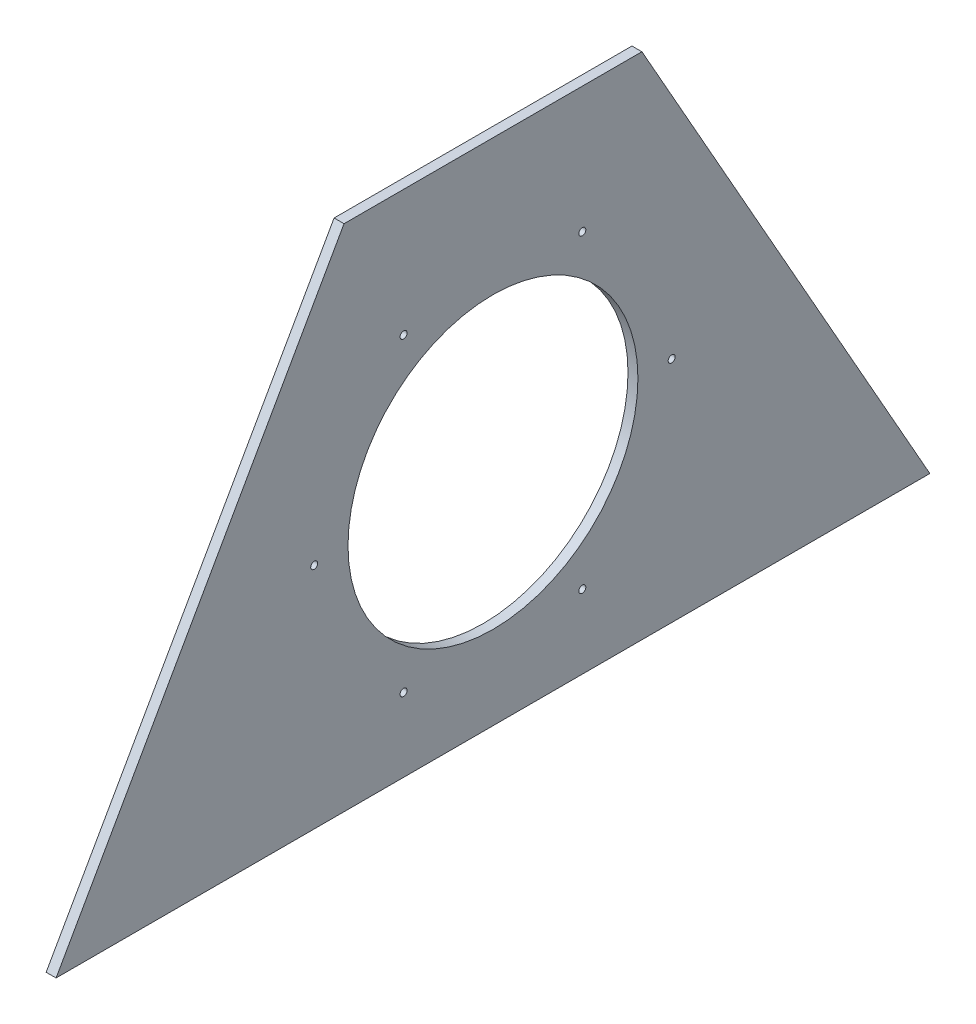
ISO-10303-21;
HEADER;
FILE_DESCRIPTION(('STEP AP214'),'2;1');
FILE_NAME('part.step','',(''),(''),'','','');
FILE_SCHEMA(('AUTOMOTIVE_DESIGN { 1 0 10303 214 1 1 1 1 }'));
ENDSEC;
DATA;
#1=APPLICATION_CONTEXT('core data for automotive mechanical design processes');
#2=APPLICATION_PROTOCOL_DEFINITION('international standard','automotive_design',2000,#1);
#3=PRODUCT_CONTEXT('',#1,'mechanical');
#4=PRODUCT('Part','Part','',(#3));
#5=PRODUCT_RELATED_PRODUCT_CATEGORY('part','',(#4));
#6=PRODUCT_DEFINITION_FORMATION('','',#4);
#7=PRODUCT_DEFINITION_CONTEXT('part definition',#1,'design');
#8=PRODUCT_DEFINITION('design','',#6,#7);
#9=PRODUCT_DEFINITION_SHAPE('','',#8);
#10=(LENGTH_UNIT() NAMED_UNIT(*) SI_UNIT(.MILLI.,.METRE.));
#11=(NAMED_UNIT(*) PLANE_ANGLE_UNIT() SI_UNIT($,.RADIAN.));
#12=(NAMED_UNIT(*) SI_UNIT($,.STERADIAN.) SOLID_ANGLE_UNIT());
#13=UNCERTAINTY_MEASURE_WITH_UNIT(LENGTH_MEASURE(1.E-05),#10,'distance_accuracy_value','');
#14=(GEOMETRIC_REPRESENTATION_CONTEXT(3) GLOBAL_UNCERTAINTY_ASSIGNED_CONTEXT((#13)) GLOBAL_UNIT_ASSIGNED_CONTEXT((#10,
#11,#12)) REPRESENTATION_CONTEXT('',''));
#15=CARTESIAN_POINT('',(0.,0.,0.));
#16=DIRECTION('',(0.,0.,1.));
#17=DIRECTION('',(1.,0.,0.));
#18=AXIS2_PLACEMENT_3D('',#15,#16,#17);
#19=CARTESIAN_POINT('',(6.35,0.,0.));
#20=DIRECTION('',(0.,-0.492192803801765,-0.870486211197947));
#21=DIRECTION('',(0.,0.870486211197947,-0.492192803801765));
#22=AXIS2_PLACEMENT_3D('',#19,#20,#21);
#23=PLANE('',#22);
#24=DIRECTION('',(0.,-0.870486211197947,0.492192803801765));
#25=VECTOR('',#24,1.);
#26=CARTESIAN_POINT('',(0.,0.,0.));
#27=LINE('',#26,#25);
#28=CARTESIAN_POINT('',(0.,325.685452030022,-184.15));
#29=VERTEX_POINT('',#28);
#30=CARTESIAN_POINT('',(0.,0.,0.));
#31=VERTEX_POINT('',#30);
#32=EDGE_CURVE('E100',#29,#31,#27,.T.);
#33=ORIENTED_EDGE('',*,*,#32,.T.);
#34=DIRECTION('',(-1.,0.,0.));
#35=VECTOR('',#34,1.);
#36=CARTESIAN_POINT('',(6.35,0.,0.));
#37=LINE('',#36,#35);
#38=CARTESIAN_POINT('',(6.35,0.,0.));
#39=VERTEX_POINT('',#38);
#40=EDGE_CURVE('E11',#39,#31,#37,.T.);
#41=ORIENTED_EDGE('',*,*,#40,.F.);
#42=DIRECTION('',(0.,-0.870486211197947,0.492192803801765));
#43=VECTOR('',#42,1.);
#44=CARTESIAN_POINT('',(6.35,0.,0.));
#45=LINE('',#44,#43);
#46=CARTESIAN_POINT('',(6.35,325.685452030022,-184.15));
#47=VERTEX_POINT('',#46);
#48=EDGE_CURVE('E87',#47,#39,#45,.T.);
#49=ORIENTED_EDGE('',*,*,#48,.F.);
#50=DIRECTION('',(-1.,0.,0.));
#51=VECTOR('',#50,1.);
#52=CARTESIAN_POINT('',(6.35,325.685452030022,-184.15));
#53=LINE('',#52,#51);
#54=EDGE_CURVE('E96',#47,#29,#53,.T.);
#55=ORIENTED_EDGE('',*,*,#54,.T.);
#56=EDGE_LOOP('',(#33,#41,#49,#55));
#57=FACE_BOUND('',#56,.T.);
#58=ADVANCED_FACE('F35',(#57),#23,.F.);
#59=CARTESIAN_POINT('',(6.35,0.,0.));
#60=DIRECTION('',(0.,1.,0.));
#61=DIRECTION('',(0.,0.,1.));
#62=AXIS2_PLACEMENT_3D('',#59,#60,#61);
#63=PLANE('',#62);
#64=DIRECTION('',(0.,0.,-1.));
#65=VECTOR('',#64,1.);
#66=CARTESIAN_POINT('',(0.,0.,0.));
#67=LINE('',#66,#65);
#68=CARTESIAN_POINT('',(0.,0.,-558.8));
#69=VERTEX_POINT('',#68);
#70=EDGE_CURVE('E91',#31,#69,#67,.T.);
#71=ORIENTED_EDGE('',*,*,#70,.T.);
#72=DIRECTION('',(-1.,0.,0.));
#73=VECTOR('',#72,1.);
#74=CARTESIAN_POINT('',(6.35,0.,-558.8));
#75=LINE('',#74,#73);
#76=CARTESIAN_POINT('',(6.35,0.,-558.8));
#77=VERTEX_POINT('',#76);
#78=EDGE_CURVE('E44',#77,#69,#75,.T.);
#79=ORIENTED_EDGE('',*,*,#78,.F.);
#80=DIRECTION('',(0.,0.,-1.));
#81=VECTOR('',#80,1.);
#82=CARTESIAN_POINT('',(6.35,0.,0.));
#83=LINE('',#82,#81);
#84=EDGE_CURVE('E82',#39,#77,#83,.T.);
#85=ORIENTED_EDGE('',*,*,#84,.F.);
#86=ORIENTED_EDGE('',*,*,#40,.T.);
#87=EDGE_LOOP('',(#71,#79,#85,#86));
#88=FACE_BOUND('',#87,.T.);
#89=ADVANCED_FACE('F90',(#88),#63,.F.);
#90=CARTESIAN_POINT('',(6.35,0.,-558.8));
#91=DIRECTION('',(0.,-0.492192803801765,0.870486211197947));
#92=DIRECTION('',(0.,-0.870486211197947,-0.492192803801765));
#93=AXIS2_PLACEMENT_3D('',#90,#91,#92);
#94=PLANE('',#93);
#95=DIRECTION('',(0.,0.870486211197947,0.492192803801765));
#96=VECTOR('',#95,1.);
#97=CARTESIAN_POINT('',(0.,0.,-558.8));
#98=LINE('',#97,#96);
#99=CARTESIAN_POINT('',(0.,325.685452030022,-374.65));
#100=VERTEX_POINT('',#99);
#101=EDGE_CURVE('E69',#69,#100,#98,.T.);
#102=ORIENTED_EDGE('',*,*,#101,.T.);
#103=DIRECTION('',(-1.,0.,0.));
#104=VECTOR('',#103,1.);
#105=CARTESIAN_POINT('',(6.35,325.685452030022,-374.65));
#106=LINE('',#105,#104);
#107=CARTESIAN_POINT('',(6.35,325.685452030022,-374.65));
#108=VERTEX_POINT('',#107);
#109=EDGE_CURVE('E92',#108,#100,#106,.T.);
#110=ORIENTED_EDGE('',*,*,#109,.F.);
#111=DIRECTION('',(0.,0.870486211197947,0.492192803801765));
#112=VECTOR('',#111,1.);
#113=CARTESIAN_POINT('',(6.35,0.,-558.8));
#114=LINE('',#113,#112);
#115=EDGE_CURVE('E85',#77,#108,#114,.T.);
#116=ORIENTED_EDGE('',*,*,#115,.F.);
#117=ORIENTED_EDGE('',*,*,#78,.T.);
#118=EDGE_LOOP('',(#102,#110,#116,#117));
#119=FACE_BOUND('',#118,.T.);
#120=ADVANCED_FACE('F94',(#119),#94,.F.);
#121=CARTESIAN_POINT('',(6.35,325.685452030022,-184.15));
#122=DIRECTION('',(0.,-1.,0.));
#123=DIRECTION('',(0.,0.,-1.));
#124=AXIS2_PLACEMENT_3D('',#121,#122,#123);
#125=PLANE('',#124);
#126=DIRECTION('',(0.,0.,1.));
#127=VECTOR('',#126,1.);
#128=CARTESIAN_POINT('',(0.,325.685452030022,-184.15));
#129=LINE('',#128,#127);
#130=EDGE_CURVE('E75',#100,#29,#129,.T.);
#131=ORIENTED_EDGE('',*,*,#130,.T.);
#132=ORIENTED_EDGE('',*,*,#54,.F.);
#133=DIRECTION('',(0.,0.,1.));
#134=VECTOR('',#133,1.);
#135=CARTESIAN_POINT('',(6.35,325.685452030022,-184.15));
#136=LINE('',#135,#134);
#137=EDGE_CURVE('E52',#108,#47,#136,.T.);
#138=ORIENTED_EDGE('',*,*,#137,.F.);
#139=ORIENTED_EDGE('',*,*,#109,.T.);
#140=EDGE_LOOP('',(#131,#132,#138,#139));
#141=FACE_BOUND('',#140,.T.);
#142=ADVANCED_FACE('F108',(#141),#125,.F.);
#143=CARTESIAN_POINT('',(6.35,0.,0.));
#144=DIRECTION('',(-1.,0.,0.));
#145=DIRECTION('',(0.,0.,1.));
#146=AXIS2_PLACEMENT_3D('',#143,#144,#145);
#147=PLANE('',#146);
#148=CARTESIAN_POINT('',(6.35,245.036703652561,-222.25));
#149=DIRECTION('',(-1.,0.,0.));
#150=DIRECTION('',(0.,0.,1.));
#151=AXIS2_PLACEMENT_3D('',#148,#149,#150);
#152=CIRCLE('',#151,2.2479);
#153=CARTESIAN_POINT('',(6.35,245.036703652561,-220.0021));
#154=VERTEX_POINT('',#153);
#155=EDGE_CURVE('E146',#154,#154,#152,.T.);
#156=ORIENTED_EDGE('',*,*,#155,.T.);
#157=EDGE_LOOP('',(#156));
#158=FACE_BOUND('',#157,.T.);
#159=CARTESIAN_POINT('',(6.35,146.05,-165.1));
#160=DIRECTION('',(-1.,0.,0.));
#161=DIRECTION('',(0.,0.,1.));
#162=AXIS2_PLACEMENT_3D('',#159,#160,#161);
#163=CIRCLE('',#162,2.2479);
#164=CARTESIAN_POINT('',(6.35,146.05,-162.8521));
#165=VERTEX_POINT('',#164);
#166=EDGE_CURVE('E140',#165,#165,#163,.T.);
#167=ORIENTED_EDGE('',*,*,#166,.T.);
#168=EDGE_LOOP('',(#167));
#169=FACE_BOUND('',#168,.T.);
#170=CARTESIAN_POINT('',(6.35,47.0632963474386,-222.25));
#171=DIRECTION('',(-1.,0.,0.));
#172=DIRECTION('',(0.,0.,1.));
#173=AXIS2_PLACEMENT_3D('',#170,#171,#172);
#174=CIRCLE('',#173,2.2479);
#175=CARTESIAN_POINT('',(6.35,47.0632963474386,-220.0021));
#176=VERTEX_POINT('',#175);
#177=EDGE_CURVE('E38',#176,#176,#174,.T.);
#178=ORIENTED_EDGE('',*,*,#177,.T.);
#179=EDGE_LOOP('',(#178));
#180=FACE_BOUND('',#179,.T.);
#181=CARTESIAN_POINT('',(6.35,47.0632963474386,-336.55));
#182=DIRECTION('',(-1.,0.,0.));
#183=DIRECTION('',(0.,0.,1.));
#184=AXIS2_PLACEMENT_3D('',#181,#182,#183);
#185=CIRCLE('',#184,2.2479);
#186=CARTESIAN_POINT('',(6.35,47.0632963474386,-334.3021));
#187=VERTEX_POINT('',#186);
#188=EDGE_CURVE('E131',#187,#187,#185,.T.);
#189=ORIENTED_EDGE('',*,*,#188,.T.);
#190=EDGE_LOOP('',(#189));
#191=FACE_BOUND('',#190,.T.);
#192=CARTESIAN_POINT('',(6.35,146.05,-393.7));
#193=DIRECTION('',(-1.,0.,0.));
#194=DIRECTION('',(0.,0.,1.));
#195=AXIS2_PLACEMENT_3D('',#192,#193,#194);
#196=CIRCLE('',#195,2.2479);
#197=CARTESIAN_POINT('',(6.35,146.05,-391.4521));
#198=VERTEX_POINT('',#197);
#199=EDGE_CURVE('E125',#198,#198,#196,.T.);
#200=ORIENTED_EDGE('',*,*,#199,.T.);
#201=EDGE_LOOP('',(#200));
#202=FACE_BOUND('',#201,.T.);
#203=CARTESIAN_POINT('',(6.35,245.036703652561,-336.55));
#204=DIRECTION('',(-1.,0.,0.));
#205=DIRECTION('',(0.,0.,1.));
#206=AXIS2_PLACEMENT_3D('',#203,#204,#205);
#207=CIRCLE('',#206,2.2479);
#208=CARTESIAN_POINT('',(6.35,245.036703652561,-334.3021));
#209=VERTEX_POINT('',#208);
#210=EDGE_CURVE('E117',#209,#209,#207,.T.);
#211=ORIENTED_EDGE('',*,*,#210,.T.);
#212=EDGE_LOOP('',(#211));
#213=FACE_BOUND('',#212,.T.);
#214=CARTESIAN_POINT('',(6.35,146.05,-279.4));
#215=DIRECTION('',(1.,0.,0.));
#216=DIRECTION('',(0.,0.,-1.));
#217=AXIS2_PLACEMENT_3D('',#214,#215,#216);
#218=CIRCLE('',#217,92.71);
#219=CARTESIAN_POINT('',(6.35,146.05,-372.11));
#220=VERTEX_POINT('',#219);
#221=EDGE_CURVE('E114',#220,#220,#218,.T.);
#222=ORIENTED_EDGE('',*,*,#221,.F.);
#223=EDGE_LOOP('',(#222));
#224=FACE_BOUND('',#223,.T.);
#225=ORIENTED_EDGE('',*,*,#48,.T.);
#226=ORIENTED_EDGE('',*,*,#84,.T.);
#227=ORIENTED_EDGE('',*,*,#115,.T.);
#228=ORIENTED_EDGE('',*,*,#137,.T.);
#229=EDGE_LOOP('',(#225,#226,#227,#228));
#230=FACE_BOUND('',#229,.T.);
#231=ADVANCED_FACE('F83',(#158,#169,#180,#191,#202,#213,#224,#230),#147,.F.);
#232=CARTESIAN_POINT('',(0.,0.,0.));
#233=DIRECTION('',(-1.,0.,0.));
#234=DIRECTION('',(0.,0.,1.));
#235=AXIS2_PLACEMENT_3D('',#232,#233,#234);
#236=PLANE('',#235);
#237=CARTESIAN_POINT('',(0.,245.036703652561,-222.25));
#238=DIRECTION('',(-1.,0.,0.));
#239=DIRECTION('',(0.,0.,1.));
#240=AXIS2_PLACEMENT_3D('',#237,#238,#239);
#241=CIRCLE('',#240,2.2479);
#242=CARTESIAN_POINT('',(0.,245.036703652561,-220.0021));
#243=VERTEX_POINT('',#242);
#244=EDGE_CURVE('E149',#243,#243,#241,.T.);
#245=ORIENTED_EDGE('',*,*,#244,.F.);
#246=EDGE_LOOP('',(#245));
#247=FACE_BOUND('',#246,.T.);
#248=CARTESIAN_POINT('',(0.,146.05,-165.1));
#249=DIRECTION('',(-1.,0.,0.));
#250=DIRECTION('',(0.,0.,1.));
#251=AXIS2_PLACEMENT_3D('',#248,#249,#250);
#252=CIRCLE('',#251,2.2479);
#253=CARTESIAN_POINT('',(0.,146.05,-162.8521));
#254=VERTEX_POINT('',#253);
#255=EDGE_CURVE('E143',#254,#254,#252,.T.);
#256=ORIENTED_EDGE('',*,*,#255,.F.);
#257=EDGE_LOOP('',(#256));
#258=FACE_BOUND('',#257,.T.);
#259=CARTESIAN_POINT('',(0.,47.0632963474386,-222.25));
#260=DIRECTION('',(-1.,0.,0.));
#261=DIRECTION('',(0.,0.,1.));
#262=AXIS2_PLACEMENT_3D('',#259,#260,#261);
#263=CIRCLE('',#262,2.2479);
#264=CARTESIAN_POINT('',(0.,47.0632963474386,-220.0021));
#265=VERTEX_POINT('',#264);
#266=EDGE_CURVE('E137',#265,#265,#263,.T.);
#267=ORIENTED_EDGE('',*,*,#266,.F.);
#268=EDGE_LOOP('',(#267));
#269=FACE_BOUND('',#268,.T.);
#270=CARTESIAN_POINT('',(0.,47.0632963474386,-336.55));
#271=DIRECTION('',(-1.,0.,0.));
#272=DIRECTION('',(0.,0.,1.));
#273=AXIS2_PLACEMENT_3D('',#270,#271,#272);
#274=CIRCLE('',#273,2.2479);
#275=CARTESIAN_POINT('',(0.,47.0632963474386,-334.3021));
#276=VERTEX_POINT('',#275);
#277=EDGE_CURVE('E134',#276,#276,#274,.T.);
#278=ORIENTED_EDGE('',*,*,#277,.F.);
#279=EDGE_LOOP('',(#278));
#280=FACE_BOUND('',#279,.T.);
#281=CARTESIAN_POINT('',(0.,146.05,-393.7));
#282=DIRECTION('',(-1.,0.,0.));
#283=DIRECTION('',(0.,0.,1.));
#284=AXIS2_PLACEMENT_3D('',#281,#282,#283);
#285=CIRCLE('',#284,2.2479);
#286=CARTESIAN_POINT('',(0.,146.05,-391.4521));
#287=VERTEX_POINT('',#286);
#288=EDGE_CURVE('E128',#287,#287,#285,.T.);
#289=ORIENTED_EDGE('',*,*,#288,.F.);
#290=EDGE_LOOP('',(#289));
#291=FACE_BOUND('',#290,.T.);
#292=CARTESIAN_POINT('',(0.,245.036703652561,-336.55));
#293=DIRECTION('',(-1.,0.,0.));
#294=DIRECTION('',(0.,0.,1.));
#295=AXIS2_PLACEMENT_3D('',#292,#293,#294);
#296=CIRCLE('',#295,2.2479);
#297=CARTESIAN_POINT('',(0.,245.036703652561,-334.3021));
#298=VERTEX_POINT('',#297);
#299=EDGE_CURVE('E122',#298,#298,#296,.T.);
#300=ORIENTED_EDGE('',*,*,#299,.F.);
#301=EDGE_LOOP('',(#300));
#302=FACE_BOUND('',#301,.T.);
#303=CARTESIAN_POINT('',(0.,146.05,-279.4));
#304=DIRECTION('',(1.,0.,0.));
#305=DIRECTION('',(0.,0.,-1.));
#306=AXIS2_PLACEMENT_3D('',#303,#304,#305);
#307=CIRCLE('',#306,92.71);
#308=CARTESIAN_POINT('',(0.,146.05,-372.11));
#309=VERTEX_POINT('',#308);
#310=EDGE_CURVE('E103',#309,#309,#307,.T.);
#311=ORIENTED_EDGE('',*,*,#310,.T.);
#312=EDGE_LOOP('',(#311));
#313=FACE_BOUND('',#312,.T.);
#314=ORIENTED_EDGE('',*,*,#32,.F.);
#315=ORIENTED_EDGE('',*,*,#130,.F.);
#316=ORIENTED_EDGE('',*,*,#101,.F.);
#317=ORIENTED_EDGE('',*,*,#70,.F.);
#318=EDGE_LOOP('',(#314,#315,#316,#317));
#319=FACE_BOUND('',#318,.T.);
#320=ADVANCED_FACE('F111',(#247,#258,#269,#280,#291,#302,#313,#319),#236,.T.);
#321=CARTESIAN_POINT('',(0.,146.05,-279.4));
#322=DIRECTION('',(1.,0.,0.));
#323=DIRECTION('',(0.,0.,-1.));
#324=AXIS2_PLACEMENT_3D('',#321,#322,#323);
#325=CYLINDRICAL_SURFACE('',#324,92.71);
#326=ORIENTED_EDGE('',*,*,#310,.F.);
#327=EDGE_LOOP('',(#326));
#328=FACE_BOUND('',#327,.T.);
#329=ORIENTED_EDGE('',*,*,#221,.T.);
#330=EDGE_LOOP('',(#329));
#331=FACE_BOUND('',#330,.T.);
#332=ADVANCED_FACE('F158',(#328,#331),#325,.F.);
#333=CARTESIAN_POINT('',(0.,245.036703652561,-336.55));
#334=DIRECTION('',(-1.,0.,0.));
#335=DIRECTION('',(0.,0.,1.));
#336=AXIS2_PLACEMENT_3D('',#333,#334,#335);
#337=CYLINDRICAL_SURFACE('',#336,2.2479);
#338=ORIENTED_EDGE('',*,*,#299,.T.);
#339=EDGE_LOOP('',(#338));
#340=FACE_BOUND('',#339,.T.);
#341=ORIENTED_EDGE('',*,*,#210,.F.);
#342=EDGE_LOOP('',(#341));
#343=FACE_BOUND('',#342,.T.);
#344=ADVANCED_FACE('F174',(#340,#343),#337,.F.);
#345=CARTESIAN_POINT('',(0.,146.05,-393.7));
#346=DIRECTION('',(-1.,0.,0.));
#347=DIRECTION('',(0.,0.,1.));
#348=AXIS2_PLACEMENT_3D('',#345,#346,#347);
#349=CYLINDRICAL_SURFACE('',#348,2.2479);
#350=ORIENTED_EDGE('',*,*,#288,.T.);
#351=EDGE_LOOP('',(#350));
#352=FACE_BOUND('',#351,.T.);
#353=ORIENTED_EDGE('',*,*,#199,.F.);
#354=EDGE_LOOP('',(#353));
#355=FACE_BOUND('',#354,.T.);
#356=ADVANCED_FACE('F225',(#352,#355),#349,.F.);
#357=CARTESIAN_POINT('',(0.,47.0632963474386,-336.55));
#358=DIRECTION('',(-1.,0.,0.));
#359=DIRECTION('',(0.,0.,1.));
#360=AXIS2_PLACEMENT_3D('',#357,#358,#359);
#361=CYLINDRICAL_SURFACE('',#360,2.2479);
#362=ORIENTED_EDGE('',*,*,#277,.T.);
#363=EDGE_LOOP('',(#362));
#364=FACE_BOUND('',#363,.T.);
#365=ORIENTED_EDGE('',*,*,#188,.F.);
#366=EDGE_LOOP('',(#365));
#367=FACE_BOUND('',#366,.T.);
#368=ADVANCED_FACE('F235',(#364,#367),#361,.F.);
#369=CARTESIAN_POINT('',(0.,47.0632963474386,-222.25));
#370=DIRECTION('',(-1.,0.,0.));
#371=DIRECTION('',(0.,0.,1.));
#372=AXIS2_PLACEMENT_3D('',#369,#370,#371);
#373=CYLINDRICAL_SURFACE('',#372,2.2479);
#374=ORIENTED_EDGE('',*,*,#266,.T.);
#375=EDGE_LOOP('',(#374));
#376=FACE_BOUND('',#375,.T.);
#377=ORIENTED_EDGE('',*,*,#177,.F.);
#378=EDGE_LOOP('',(#377));
#379=FACE_BOUND('',#378,.T.);
#380=ADVANCED_FACE('F245',(#376,#379),#373,.F.);
#381=CARTESIAN_POINT('',(0.,146.05,-165.1));
#382=DIRECTION('',(-1.,0.,0.));
#383=DIRECTION('',(0.,0.,1.));
#384=AXIS2_PLACEMENT_3D('',#381,#382,#383);
#385=CYLINDRICAL_SURFACE('',#384,2.2479);
#386=ORIENTED_EDGE('',*,*,#255,.T.);
#387=EDGE_LOOP('',(#386));
#388=FACE_BOUND('',#387,.T.);
#389=ORIENTED_EDGE('',*,*,#166,.F.);
#390=EDGE_LOOP('',(#389));
#391=FACE_BOUND('',#390,.T.);
#392=ADVANCED_FACE('F255',(#388,#391),#385,.F.);
#393=CARTESIAN_POINT('',(0.,245.036703652561,-222.25));
#394=DIRECTION('',(-1.,0.,0.));
#395=DIRECTION('',(0.,0.,1.));
#396=AXIS2_PLACEMENT_3D('',#393,#394,#395);
#397=CYLINDRICAL_SURFACE('',#396,2.2479);
#398=ORIENTED_EDGE('',*,*,#244,.T.);
#399=EDGE_LOOP('',(#398));
#400=FACE_BOUND('',#399,.T.);
#401=ORIENTED_EDGE('',*,*,#155,.F.);
#402=EDGE_LOOP('',(#401));
#403=FACE_BOUND('',#402,.T.);
#404=ADVANCED_FACE('F153',(#400,#403),#397,.F.);
#405=CLOSED_SHELL('',(#58,#89,#120,#142,#231,#320,#332,#344,#356,#368,#380,#392,#404));
#406=MANIFOLD_SOLID_BREP('B2',#405);
#407=ADVANCED_BREP_SHAPE_REPRESENTATION('',(#18,#406),#14);
#408=SHAPE_DEFINITION_REPRESENTATION(#9,#407);
ENDSEC;
END-ISO-10303-21;
